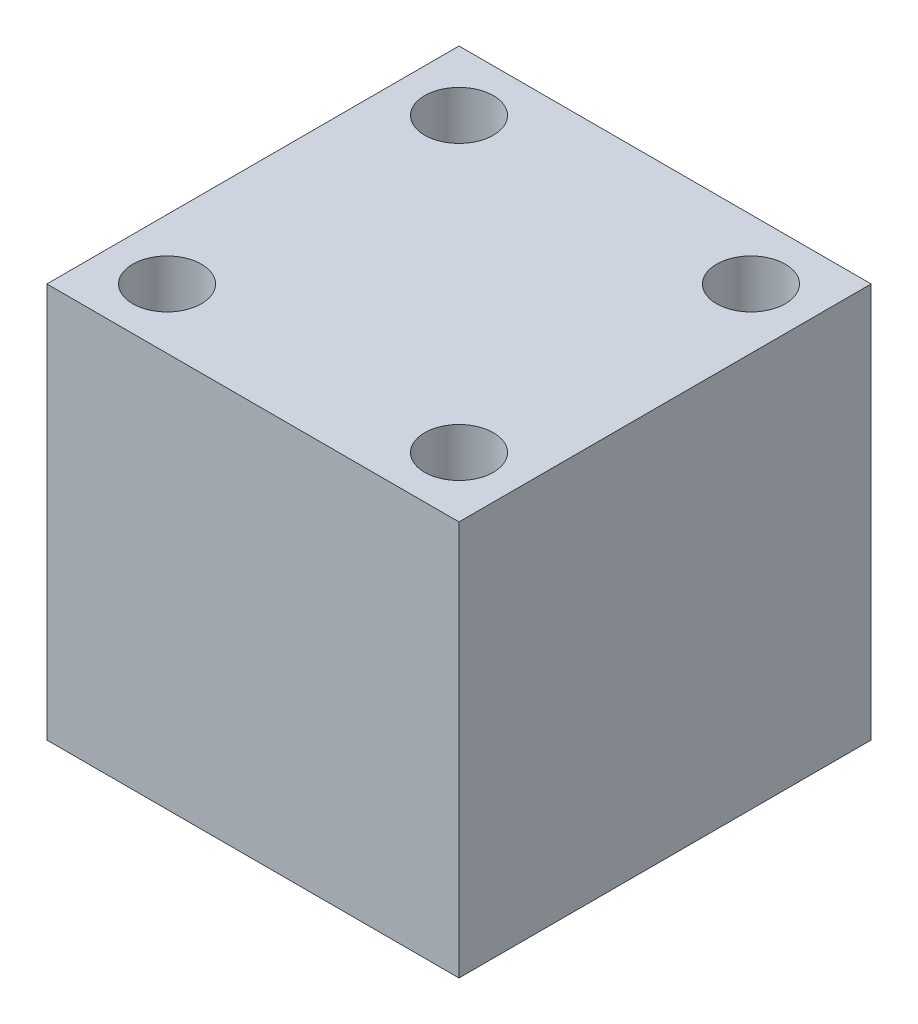
ISO-10303-21;
HEADER;
FILE_DESCRIPTION(('STEP AP214'),'2;1');
FILE_NAME('part.step','',(''),(''),'','','');
FILE_SCHEMA(('AUTOMOTIVE_DESIGN { 1 0 10303 214 1 1 1 1 }'));
ENDSEC;
DATA;
#1=APPLICATION_CONTEXT('core data for automotive mechanical design processes');
#2=APPLICATION_PROTOCOL_DEFINITION('international standard','automotive_design',2000,#1);
#3=PRODUCT_CONTEXT('',#1,'mechanical');
#4=PRODUCT('Part','Part','',(#3));
#5=PRODUCT_RELATED_PRODUCT_CATEGORY('part','',(#4));
#6=PRODUCT_DEFINITION_FORMATION('','',#4);
#7=PRODUCT_DEFINITION_CONTEXT('part definition',#1,'design');
#8=PRODUCT_DEFINITION('design','',#6,#7);
#9=PRODUCT_DEFINITION_SHAPE('','',#8);
#10=(LENGTH_UNIT() NAMED_UNIT(*) SI_UNIT(.MILLI.,.METRE.));
#11=(NAMED_UNIT(*) PLANE_ANGLE_UNIT() SI_UNIT($,.RADIAN.));
#12=(NAMED_UNIT(*) SI_UNIT($,.STERADIAN.) SOLID_ANGLE_UNIT());
#13=UNCERTAINTY_MEASURE_WITH_UNIT(LENGTH_MEASURE(1.E-05),#10,'distance_accuracy_value','');
#14=(GEOMETRIC_REPRESENTATION_CONTEXT(3) GLOBAL_UNCERTAINTY_ASSIGNED_CONTEXT((#13)) GLOBAL_UNIT_ASSIGNED_CONTEXT((#10,
#11,#12)) REPRESENTATION_CONTEXT('',''));
#15=CARTESIAN_POINT('',(0.,0.,0.));
#16=DIRECTION('',(0.,0.,1.));
#17=DIRECTION('',(1.,0.,0.));
#18=AXIS2_PLACEMENT_3D('',#15,#16,#17);
#19=CARTESIAN_POINT('',(-32.310988842807,-40.2795376342654,6.99999999999999));
#20=DIRECTION('',(0.,-1.,0.));
#21=DIRECTION('',(0.,0.,-1.));
#22=AXIS2_PLACEMENT_3D('',#19,#20,#21);
#23=PLANE('',#22);
#24=DIRECTION('',(-1.,0.,0.));
#25=VECTOR('',#24,1.);
#26=CARTESIAN_POINT('',(-32.310988842807,-40.2795376342654,-29.));
#27=LINE('',#26,#25);
#28=CARTESIAN_POINT('',(36.,-40.2795376342654,-29.));
#29=VERTEX_POINT('',#28);
#30=CARTESIAN_POINT('',(0.,-40.2795376342654,-29.));
#31=VERTEX_POINT('',#30);
#32=EDGE_CURVE('E102',#29,#31,#27,.T.);
#33=ORIENTED_EDGE('',*,*,#32,.F.);
#34=DIRECTION('',(0.,0.,-1.));
#35=VECTOR('',#34,1.);
#36=CARTESIAN_POINT('',(36.,-40.2795376342654,6.99999999999999));
#37=LINE('',#36,#35);
#38=CARTESIAN_POINT('',(36.,-40.2795376342654,6.99999999999999));
#39=VERTEX_POINT('',#38);
#40=EDGE_CURVE('E11',#39,#29,#37,.T.);
#41=ORIENTED_EDGE('',*,*,#40,.F.);
#42=DIRECTION('',(-1.,0.,0.));
#43=VECTOR('',#42,1.);
#44=CARTESIAN_POINT('',(-32.310988842807,-40.2795376342654,6.99999999999999));
#45=LINE('',#44,#43);
#46=CARTESIAN_POINT('',(0.,-40.2795376342654,6.99999999999999));
#47=VERTEX_POINT('',#46);
#48=EDGE_CURVE('E95',#39,#47,#45,.T.);
#49=ORIENTED_EDGE('',*,*,#48,.T.);
#50=DIRECTION('',(0.,0.,-1.));
#51=VECTOR('',#50,1.);
#52=CARTESIAN_POINT('',(0.,-40.2795376342654,6.99999999999999));
#53=LINE('',#52,#51);
#54=EDGE_CURVE('E40',#47,#31,#53,.T.);
#55=ORIENTED_EDGE('',*,*,#54,.T.);
#56=EDGE_LOOP('',(#33,#41,#49,#55));
#57=FACE_BOUND('',#56,.T.);
#58=ADVANCED_FACE('F37',(#57),#23,.T.);
#59=CARTESIAN_POINT('',(36.,-5.77953763426535,6.99999999999999));
#60=DIRECTION('',(1.,0.,0.));
#61=DIRECTION('',(0.,1.,0.));
#62=AXIS2_PLACEMENT_3D('',#59,#60,#61);
#63=PLANE('',#62);
#64=DIRECTION('',(0.,-1.,0.));
#65=VECTOR('',#64,1.);
#66=CARTESIAN_POINT('',(36.,-5.77953763426535,-29.));
#67=LINE('',#66,#65);
#68=CARTESIAN_POINT('',(36.,-5.77953763426536,-29.));
#69=VERTEX_POINT('',#68);
#70=EDGE_CURVE('E97',#69,#29,#67,.T.);
#71=ORIENTED_EDGE('',*,*,#70,.F.);
#72=DIRECTION('',(0.,0.,-1.));
#73=VECTOR('',#72,1.);
#74=CARTESIAN_POINT('',(36.,-5.77953763426536,6.99999999999999));
#75=LINE('',#74,#73);
#76=CARTESIAN_POINT('',(36.,-5.77953763426536,6.99999999999999));
#77=VERTEX_POINT('',#76);
#78=EDGE_CURVE('E46',#77,#69,#75,.T.);
#79=ORIENTED_EDGE('',*,*,#78,.F.);
#80=DIRECTION('',(0.,-1.,0.));
#81=VECTOR('',#80,1.);
#82=CARTESIAN_POINT('',(36.,-5.77953763426535,6.99999999999999));
#83=LINE('',#82,#81);
#84=EDGE_CURVE('E92',#77,#39,#83,.T.);
#85=ORIENTED_EDGE('',*,*,#84,.T.);
#86=ORIENTED_EDGE('',*,*,#40,.T.);
#87=EDGE_LOOP('',(#71,#79,#85,#86));
#88=FACE_BOUND('',#87,.T.);
#89=ADVANCED_FACE('F113',(#88),#63,.T.);
#90=CARTESIAN_POINT('',(-32.310988842807,-5.77953763426536,6.99999999999999));
#91=DIRECTION('',(0.,1.,0.));
#92=DIRECTION('',(0.,0.,1.));
#93=AXIS2_PLACEMENT_3D('',#90,#91,#92);
#94=PLANE('',#93);
#95=CARTESIAN_POINT('',(5.25,-5.77953763426536,-23.75));
#96=DIRECTION('',(0.,1.,0.));
#97=DIRECTION('',(0.,0.,1.));
#98=AXIS2_PLACEMENT_3D('',#95,#96,#97);
#99=CIRCLE('',#98,3.);
#100=CARTESIAN_POINT('',(5.25,-5.77953763426536,-20.75));
#101=VERTEX_POINT('',#100);
#102=EDGE_CURVE('E184',#101,#101,#99,.T.);
#103=ORIENTED_EDGE('',*,*,#102,.F.);
#104=EDGE_LOOP('',(#103));
#105=FACE_BOUND('',#104,.T.);
#106=CARTESIAN_POINT('',(5.25,-5.77953763426536,1.75));
#107=DIRECTION('',(0.,1.,0.));
#108=DIRECTION('',(0.,0.,1.));
#109=AXIS2_PLACEMENT_3D('',#106,#107,#108);
#110=CIRCLE('',#109,3.);
#111=CARTESIAN_POINT('',(5.25,-5.77953763426536,4.75));
#112=VERTEX_POINT('',#111);
#113=EDGE_CURVE('E176',#112,#112,#110,.T.);
#114=ORIENTED_EDGE('',*,*,#113,.F.);
#115=EDGE_LOOP('',(#114));
#116=FACE_BOUND('',#115,.T.);
#117=CARTESIAN_POINT('',(30.75,-5.77953763426536,1.75));
#118=DIRECTION('',(0.,1.,0.));
#119=DIRECTION('',(0.,0.,1.));
#120=AXIS2_PLACEMENT_3D('',#117,#118,#119);
#121=CIRCLE('',#120,2.99999999999999);
#122=CARTESIAN_POINT('',(30.75,-5.77953763426536,4.74999999999999));
#123=VERTEX_POINT('',#122);
#124=EDGE_CURVE('E171',#123,#123,#121,.T.);
#125=ORIENTED_EDGE('',*,*,#124,.F.);
#126=EDGE_LOOP('',(#125));
#127=FACE_BOUND('',#126,.T.);
#128=CARTESIAN_POINT('',(30.75,-5.77953763426536,-23.75));
#129=DIRECTION('',(0.,1.,0.));
#130=DIRECTION('',(0.,0.,1.));
#131=AXIS2_PLACEMENT_3D('',#128,#129,#130);
#132=CIRCLE('',#131,2.99999999999998);
#133=CARTESIAN_POINT('',(30.75,-5.77953763426536,-20.75));
#134=VERTEX_POINT('',#133);
#135=EDGE_CURVE('E173',#134,#134,#132,.T.);
#136=ORIENTED_EDGE('',*,*,#135,.F.);
#137=EDGE_LOOP('',(#136));
#138=FACE_BOUND('',#137,.T.);
#139=DIRECTION('',(1.,0.,0.));
#140=VECTOR('',#139,1.);
#141=CARTESIAN_POINT('',(-32.310988842807,-5.77953763426536,-29.));
#142=LINE('',#141,#140);
#143=CARTESIAN_POINT('',(0.,-5.77953763426536,-29.));
#144=VERTEX_POINT('',#143);
#145=EDGE_CURVE('E87',#144,#69,#142,.T.);
#146=ORIENTED_EDGE('',*,*,#145,.F.);
#147=DIRECTION('',(0.,0.,-1.));
#148=VECTOR('',#147,1.);
#149=CARTESIAN_POINT('',(0.,-5.77953763426536,6.99999999999999));
#150=LINE('',#149,#148);
#151=CARTESIAN_POINT('',(0.,-5.77953763426536,6.99999999999999));
#152=VERTEX_POINT('',#151);
#153=EDGE_CURVE('E82',#152,#144,#150,.T.);
#154=ORIENTED_EDGE('',*,*,#153,.F.);
#155=DIRECTION('',(1.,0.,0.));
#156=VECTOR('',#155,1.);
#157=CARTESIAN_POINT('',(-32.310988842807,-5.77953763426536,6.99999999999999));
#158=LINE('',#157,#156);
#159=EDGE_CURVE('E85',#152,#77,#158,.T.);
#160=ORIENTED_EDGE('',*,*,#159,.T.);
#161=ORIENTED_EDGE('',*,*,#78,.T.);
#162=EDGE_LOOP('',(#146,#154,#160,#161));
#163=FACE_BOUND('',#162,.T.);
#164=ADVANCED_FACE('F84',(#105,#116,#127,#138,#163),#94,.T.);
#165=CARTESIAN_POINT('',(0.,-5.77953763426536,6.99999999999999));
#166=DIRECTION('',(-1.,0.,0.));
#167=DIRECTION('',(0.,-1.,0.));
#168=AXIS2_PLACEMENT_3D('',#165,#166,#167);
#169=PLANE('',#168);
#170=DIRECTION('',(0.,1.,0.));
#171=VECTOR('',#170,1.);
#172=CARTESIAN_POINT('',(0.,-5.77953763426536,-29.));
#173=LINE('',#172,#171);
#174=EDGE_CURVE('E105',#31,#144,#173,.T.);
#175=ORIENTED_EDGE('',*,*,#174,.F.);
#176=ORIENTED_EDGE('',*,*,#54,.F.);
#177=DIRECTION('',(0.,1.,0.));
#178=VECTOR('',#177,1.);
#179=CARTESIAN_POINT('',(0.,-5.77953763426536,6.99999999999999));
#180=LINE('',#179,#178);
#181=EDGE_CURVE('E91',#47,#152,#180,.T.);
#182=ORIENTED_EDGE('',*,*,#181,.T.);
#183=ORIENTED_EDGE('',*,*,#153,.T.);
#184=EDGE_LOOP('',(#175,#176,#182,#183));
#185=FACE_BOUND('',#184,.T.);
#186=ADVANCED_FACE('F94',(#185),#169,.T.);
#187=CARTESIAN_POINT('',(0.,0.,6.99999999999999));
#188=DIRECTION('',(0.,0.,-1.));
#189=DIRECTION('',(0.,1.,0.));
#190=AXIS2_PLACEMENT_3D('',#187,#188,#189);
#191=PLANE('',#190);
#192=ORIENTED_EDGE('',*,*,#48,.F.);
#193=ORIENTED_EDGE('',*,*,#84,.F.);
#194=ORIENTED_EDGE('',*,*,#159,.F.);
#195=ORIENTED_EDGE('',*,*,#181,.F.);
#196=EDGE_LOOP('',(#192,#193,#194,#195));
#197=FACE_BOUND('',#196,.T.);
#198=ADVANCED_FACE('F90',(#197),#191,.F.);
#199=CARTESIAN_POINT('',(0.,0.,-29.));
#200=DIRECTION('',(0.,0.,-1.));
#201=DIRECTION('',(0.,1.,0.));
#202=AXIS2_PLACEMENT_3D('',#199,#200,#201);
#203=PLANE('',#202);
#204=ORIENTED_EDGE('',*,*,#32,.T.);
#205=ORIENTED_EDGE('',*,*,#174,.T.);
#206=ORIENTED_EDGE('',*,*,#145,.T.);
#207=ORIENTED_EDGE('',*,*,#70,.T.);
#208=EDGE_LOOP('',(#204,#205,#206,#207));
#209=FACE_BOUND('',#208,.T.);
#210=ADVANCED_FACE('F112',(#209),#203,.T.);
#211=CARTESIAN_POINT('',(30.75,-10.7795376342654,-23.75));
#212=DIRECTION('',(0.,1.,0.));
#213=DIRECTION('',(0.,0.,1.));
#214=AXIS2_PLACEMENT_3D('',#211,#212,#213);
#215=CYLINDRICAL_SURFACE('',#214,2.99999999999998);
#216=CARTESIAN_POINT('',(30.75,-10.7795376342654,-23.75));
#217=DIRECTION('',(0.,1.,0.));
#218=DIRECTION('',(0.,0.,1.));
#219=AXIS2_PLACEMENT_3D('',#216,#217,#218);
#220=CIRCLE('',#219,2.99999999999998);
#221=CARTESIAN_POINT('',(30.75,-10.7795376342654,-20.75));
#222=VERTEX_POINT('',#221);
#223=EDGE_CURVE('E106',#222,#222,#220,.T.);
#224=ORIENTED_EDGE('',*,*,#223,.F.);
#225=EDGE_LOOP('',(#224));
#226=FACE_BOUND('',#225,.T.);
#227=ORIENTED_EDGE('',*,*,#135,.T.);
#228=EDGE_LOOP('',(#227));
#229=FACE_BOUND('',#228,.T.);
#230=ADVANCED_FACE('F131',(#226,#229),#215,.F.);
#231=CARTESIAN_POINT('',(30.75,-10.7795376342654,-23.75));
#232=DIRECTION('',(0.,1.,0.));
#233=DIRECTION('',(0.,0.,1.));
#234=AXIS2_PLACEMENT_3D('',#231,#232,#233);
#235=PLANE('',#234);
#236=ORIENTED_EDGE('',*,*,#223,.T.);
#237=EDGE_LOOP('',(#236));
#238=FACE_BOUND('',#237,.T.);
#239=ADVANCED_FACE('F135',(#238),#235,.T.);
#240=CARTESIAN_POINT('',(30.75,-10.7795376342654,1.75));
#241=DIRECTION('',(0.,1.,0.));
#242=DIRECTION('',(0.,0.,1.));
#243=AXIS2_PLACEMENT_3D('',#240,#241,#242);
#244=CYLINDRICAL_SURFACE('',#243,2.99999999999999);
#245=CARTESIAN_POINT('',(30.75,-10.7795376342654,1.75));
#246=DIRECTION('',(0.,1.,0.));
#247=DIRECTION('',(0.,0.,1.));
#248=AXIS2_PLACEMENT_3D('',#245,#246,#247);
#249=CIRCLE('',#248,2.99999999999999);
#250=CARTESIAN_POINT('',(30.75,-10.7795376342654,4.74999999999999));
#251=VERTEX_POINT('',#250);
#252=EDGE_CURVE('E168',#251,#251,#249,.T.);
#253=ORIENTED_EDGE('',*,*,#252,.F.);
#254=EDGE_LOOP('',(#253));
#255=FACE_BOUND('',#254,.T.);
#256=ORIENTED_EDGE('',*,*,#124,.T.);
#257=EDGE_LOOP('',(#256));
#258=FACE_BOUND('',#257,.T.);
#259=ADVANCED_FACE('F139',(#255,#258),#244,.F.);
#260=CARTESIAN_POINT('',(30.75,-10.7795376342654,1.75));
#261=DIRECTION('',(0.,1.,0.));
#262=DIRECTION('',(0.,0.,1.));
#263=AXIS2_PLACEMENT_3D('',#260,#261,#262);
#264=PLANE('',#263);
#265=ORIENTED_EDGE('',*,*,#252,.T.);
#266=EDGE_LOOP('',(#265));
#267=FACE_BOUND('',#266,.T.);
#268=ADVANCED_FACE('F156',(#267),#264,.T.);
#269=CARTESIAN_POINT('',(5.25,-10.7795376342654,1.75));
#270=DIRECTION('',(0.,1.,0.));
#271=DIRECTION('',(0.,0.,1.));
#272=AXIS2_PLACEMENT_3D('',#269,#270,#271);
#273=CYLINDRICAL_SURFACE('',#272,3.);
#274=CARTESIAN_POINT('',(5.25,-10.7795376342654,1.75));
#275=DIRECTION('',(0.,1.,0.));
#276=DIRECTION('',(0.,0.,1.));
#277=AXIS2_PLACEMENT_3D('',#274,#275,#276);
#278=CIRCLE('',#277,3.);
#279=CARTESIAN_POINT('',(5.25,-10.7795376342654,4.75));
#280=VERTEX_POINT('',#279);
#281=EDGE_CURVE('E181',#280,#280,#278,.T.);
#282=ORIENTED_EDGE('',*,*,#281,.F.);
#283=EDGE_LOOP('',(#282));
#284=FACE_BOUND('',#283,.T.);
#285=ORIENTED_EDGE('',*,*,#113,.T.);
#286=EDGE_LOOP('',(#285));
#287=FACE_BOUND('',#286,.T.);
#288=ADVANCED_FACE('F152',(#284,#287),#273,.F.);
#289=CARTESIAN_POINT('',(5.25,-10.7795376342654,1.75));
#290=DIRECTION('',(0.,1.,0.));
#291=DIRECTION('',(0.,0.,1.));
#292=AXIS2_PLACEMENT_3D('',#289,#290,#291);
#293=PLANE('',#292);
#294=ORIENTED_EDGE('',*,*,#281,.T.);
#295=EDGE_LOOP('',(#294));
#296=FACE_BOUND('',#295,.T.);
#297=ADVANCED_FACE('F148',(#296),#293,.T.);
#298=CARTESIAN_POINT('',(5.25,-10.7795376342654,-23.75));
#299=DIRECTION('',(0.,1.,0.));
#300=DIRECTION('',(0.,0.,1.));
#301=AXIS2_PLACEMENT_3D('',#298,#299,#300);
#302=CYLINDRICAL_SURFACE('',#301,3.);
#303=CARTESIAN_POINT('',(5.25,-10.7795376342654,-23.75));
#304=DIRECTION('',(0.,1.,0.));
#305=DIRECTION('',(0.,0.,1.));
#306=AXIS2_PLACEMENT_3D('',#303,#304,#305);
#307=CIRCLE('',#306,3.);
#308=CARTESIAN_POINT('',(5.25,-10.7795376342654,-20.75));
#309=VERTEX_POINT('',#308);
#310=EDGE_CURVE('E187',#309,#309,#307,.T.);
#311=ORIENTED_EDGE('',*,*,#310,.F.);
#312=EDGE_LOOP('',(#311));
#313=FACE_BOUND('',#312,.T.);
#314=ORIENTED_EDGE('',*,*,#102,.T.);
#315=EDGE_LOOP('',(#314));
#316=FACE_BOUND('',#315,.T.);
#317=ADVANCED_FACE('F144',(#313,#316),#302,.F.);
#318=CARTESIAN_POINT('',(5.25,-10.7795376342654,-23.75));
#319=DIRECTION('',(0.,1.,0.));
#320=DIRECTION('',(0.,0.,1.));
#321=AXIS2_PLACEMENT_3D('',#318,#319,#320);
#322=PLANE('',#321);
#323=ORIENTED_EDGE('',*,*,#310,.T.);
#324=EDGE_LOOP('',(#323));
#325=FACE_BOUND('',#324,.T.);
#326=ADVANCED_FACE('F141',(#325),#322,.T.);
#327=CLOSED_SHELL('',(#58,#89,#164,#186,#198,#210,#230,#239,#259,#268,#288,#297,#317,#326));
#328=MANIFOLD_SOLID_BREP('B2',#327);
#329=ADVANCED_BREP_SHAPE_REPRESENTATION('',(#18,#328),#14);
#330=SHAPE_DEFINITION_REPRESENTATION(#9,#329);
ENDSEC;
END-ISO-10303-21;
